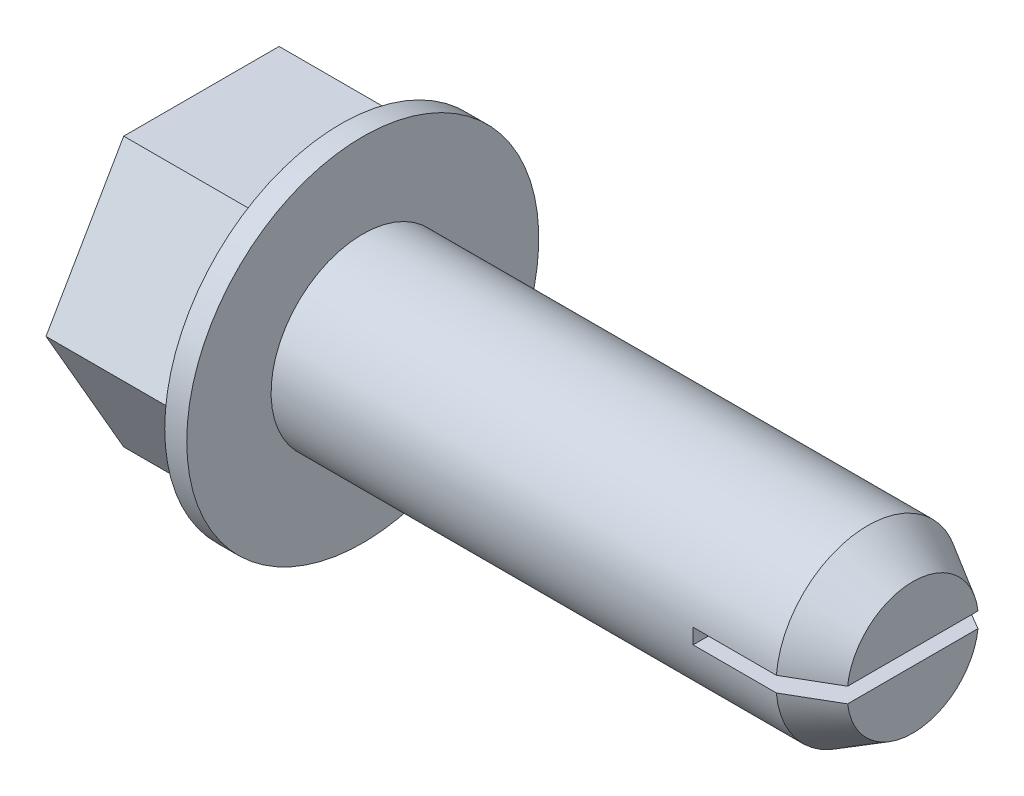
ISO-10303-21;
HEADER;
FILE_DESCRIPTION(('STEP AP214'),'2;1');
FILE_NAME('part.step','',(''),(''),'','','');
FILE_SCHEMA(('AUTOMOTIVE_DESIGN { 1 0 10303 214 1 1 1 1 }'));
ENDSEC;
DATA;
#1=APPLICATION_CONTEXT('core data for automotive mechanical design processes');
#2=APPLICATION_PROTOCOL_DEFINITION('international standard','automotive_design',2000,#1);
#3=PRODUCT_CONTEXT('',#1,'mechanical');
#4=PRODUCT('Part','Part','',(#3));
#5=PRODUCT_RELATED_PRODUCT_CATEGORY('part','',(#4));
#6=PRODUCT_DEFINITION_FORMATION('','',#4);
#7=PRODUCT_DEFINITION_CONTEXT('part definition',#1,'design');
#8=PRODUCT_DEFINITION('design','',#6,#7);
#9=PRODUCT_DEFINITION_SHAPE('','',#8);
#10=(LENGTH_UNIT() NAMED_UNIT(*) SI_UNIT(.MILLI.,.METRE.));
#11=(NAMED_UNIT(*) PLANE_ANGLE_UNIT() SI_UNIT($,.RADIAN.));
#12=(NAMED_UNIT(*) SI_UNIT($,.STERADIAN.) SOLID_ANGLE_UNIT());
#13=UNCERTAINTY_MEASURE_WITH_UNIT(LENGTH_MEASURE(1.E-05),#10,'distance_accuracy_value','');
#14=(GEOMETRIC_REPRESENTATION_CONTEXT(3) GLOBAL_UNCERTAINTY_ASSIGNED_CONTEXT((#13)) GLOBAL_UNIT_ASSIGNED_CONTEXT((#10,
#11,#12)) REPRESENTATION_CONTEXT('',''));
#15=CARTESIAN_POINT('',(0.,0.,0.));
#16=DIRECTION('',(0.,0.,1.));
#17=DIRECTION('',(1.,0.,0.));
#18=AXIS2_PLACEMENT_3D('',#15,#16,#17);
#19=CARTESIAN_POINT('',(14.605,0.,0.));
#20=DIRECTION('',(1.,0.,0.));
#21=DIRECTION('',(0.,0.,-1.));
#22=AXIS2_PLACEMENT_3D('',#19,#20,#21);
#23=PLANE('',#22);
#24=CARTESIAN_POINT('',(14.605,0.,0.));
#25=DIRECTION('',(1.,0.,0.));
#26=DIRECTION('',(0.,0.,-1.));
#27=AXIS2_PLACEMENT_3D('',#24,#25,#26);
#28=CIRCLE('',#27,3.175);
#29=CARTESIAN_POINT('',(14.605,-0.264583333333333,-3.16395648827891));
#30=VERTEX_POINT('',#29);
#31=CARTESIAN_POINT('',(14.605,0.264583333333333,-3.16395648827891));
#32=VERTEX_POINT('',#31);
#33=EDGE_CURVE('E167',#30,#32,#28,.T.);
#34=ORIENTED_EDGE('',*,*,#33,.T.);
#35=DIRECTION('',(0.,0.,-1.));
#36=VECTOR('',#35,1.);
#37=CARTESIAN_POINT('',(14.605,0.264583333333333,-3.16395648827891));
#38=LINE('',#37,#36);
#39=CARTESIAN_POINT('',(14.605,0.264583333333333,3.16395648827891));
#40=VERTEX_POINT('',#39);
#41=EDGE_CURVE('E151',#40,#32,#38,.T.);
#42=ORIENTED_EDGE('',*,*,#41,.F.);
#43=CARTESIAN_POINT('',(14.605,-0.264583333333333,3.16395648827891));
#44=VERTEX_POINT('',#43);
#45=EDGE_CURVE('E171',#40,#44,#28,.T.);
#46=ORIENTED_EDGE('',*,*,#45,.T.);
#47=DIRECTION('',(0.,0.,-1.));
#48=VECTOR('',#47,1.);
#49=CARTESIAN_POINT('',(14.605,-0.264583333333333,3.16395648827891));
#50=LINE('',#49,#48);
#51=EDGE_CURVE('E170',#44,#30,#50,.T.);
#52=ORIENTED_EDGE('',*,*,#51,.T.);
#53=EDGE_LOOP('',(#34,#42,#46,#52));
#54=FACE_BOUND('',#53,.T.);
#55=ADVANCED_FACE('F32',(#54),#23,.T.);
#56=CARTESIAN_POINT('',(0.,0.,0.));
#57=DIRECTION('',(-1.,0.,0.));
#58=DIRECTION('',(0.,0.,1.));
#59=AXIS2_PLACEMENT_3D('',#56,#57,#58);
#60=CYLINDRICAL_SURFACE('',#59,6.096);
#61=CARTESIAN_POINT('',(0.,0.,0.));
#62=DIRECTION('',(-1.,0.,0.));
#63=DIRECTION('',(0.,0.,1.));
#64=AXIS2_PLACEMENT_3D('',#61,#62,#63);
#65=CIRCLE('',#64,6.096);
#66=CARTESIAN_POINT('',(0.,0.,6.096));
#67=VERTEX_POINT('',#66);
#68=EDGE_CURVE('E185',#67,#67,#65,.T.);
#69=ORIENTED_EDGE('',*,*,#68,.T.);
#70=EDGE_LOOP('',(#69));
#71=FACE_BOUND('',#70,.T.);
#72=CARTESIAN_POINT('',(-0.762,0.,0.));
#73=DIRECTION('',(-1.,0.,0.));
#74=DIRECTION('',(0.,0.,1.));
#75=AXIS2_PLACEMENT_3D('',#72,#73,#74);
#76=CIRCLE('',#75,6.096);
#77=CARTESIAN_POINT('',(-0.762,0.,6.096));
#78=VERTEX_POINT('',#77);
#79=EDGE_CURVE('E179',#78,#78,#76,.T.);
#80=ORIENTED_EDGE('',*,*,#79,.F.);
#81=EDGE_LOOP('',(#80));
#82=FACE_BOUND('',#81,.T.);
#83=ADVANCED_FACE('F217',(#71,#82),#60,.T.);
#84=CARTESIAN_POINT('',(0.,6.096,0.));
#85=DIRECTION('',(1.,0.,0.));
#86=DIRECTION('',(0.,0.,-1.));
#87=AXIS2_PLACEMENT_3D('',#84,#85,#86);
#88=PLANE('',#87);
#89=CARTESIAN_POINT('',(0.,0.,0.));
#90=DIRECTION('',(1.,0.,0.));
#91=DIRECTION('',(0.,0.,-1.));
#92=AXIS2_PLACEMENT_3D('',#89,#90,#91);
#93=CIRCLE('',#92,3.175);
#94=CARTESIAN_POINT('',(0.,0.,-3.175));
#95=VERTEX_POINT('',#94);
#96=EDGE_CURVE('E181',#95,#95,#93,.T.);
#97=ORIENTED_EDGE('',*,*,#96,.F.);
#98=EDGE_LOOP('',(#97));
#99=FACE_BOUND('',#98,.T.);
#100=ORIENTED_EDGE('',*,*,#68,.F.);
#101=EDGE_LOOP('',(#100));
#102=FACE_BOUND('',#101,.T.);
#103=ADVANCED_FACE('F332',(#99,#102),#88,.T.);
#104=CARTESIAN_POINT('',(-0.762,0.,0.));
#105=DIRECTION('',(-1.,0.,0.));
#106=DIRECTION('',(0.,0.,1.));
#107=AXIS2_PLACEMENT_3D('',#104,#105,#106);
#108=PLANE('',#107);
#109=DIRECTION('',(0.,0.,1.));
#110=VECTOR('',#109,1.);
#111=CARTESIAN_POINT('',(-0.762,-4.6609,2.69097186966593));
#112=LINE('',#111,#110);
#113=CARTESIAN_POINT('',(-0.762,-4.6609,-2.69097186966593));
#114=VERTEX_POINT('',#113);
#115=CARTESIAN_POINT('',(-0.762,-4.6609,2.69097186966593));
#116=VERTEX_POINT('',#115);
#117=EDGE_CURVE('E150',#114,#116,#112,.T.);
#118=ORIENTED_EDGE('',*,*,#117,.F.);
#119=DIRECTION('',(0.,-0.866025403784439,0.5));
#120=VECTOR('',#119,1.);
#121=CARTESIAN_POINT('',(-0.762,-4.6609,-2.69097186966593));
#122=LINE('',#121,#120);
#123=CARTESIAN_POINT('',(-0.762,0.,-5.38194373933185));
#124=VERTEX_POINT('',#123);
#125=EDGE_CURVE('E147',#124,#114,#122,.T.);
#126=ORIENTED_EDGE('',*,*,#125,.F.);
#127=DIRECTION('',(0.,-0.866025403784439,-0.5));
#128=VECTOR('',#127,1.);
#129=CARTESIAN_POINT('',(-0.762,0.,-5.38194373933185));
#130=LINE('',#129,#128);
#131=CARTESIAN_POINT('',(-0.762,4.6609,-2.69097186966592));
#132=VERTEX_POINT('',#131);
#133=EDGE_CURVE('E311',#132,#124,#130,.T.);
#134=ORIENTED_EDGE('',*,*,#133,.F.);
#135=DIRECTION('',(0.,0.,-1.));
#136=VECTOR('',#135,1.);
#137=CARTESIAN_POINT('',(-0.762,4.6609,-2.69097186966592));
#138=LINE('',#137,#136);
#139=CARTESIAN_POINT('',(-0.762,4.6609,2.69097186966593));
#140=VERTEX_POINT('',#139);
#141=EDGE_CURVE('E308',#140,#132,#138,.T.);
#142=ORIENTED_EDGE('',*,*,#141,.F.);
#143=DIRECTION('',(0.,0.866025403784439,-0.5));
#144=VECTOR('',#143,1.);
#145=CARTESIAN_POINT('',(-0.762,4.6609,2.69097186966593));
#146=LINE('',#145,#144);
#147=CARTESIAN_POINT('',(-0.762,0.,5.38194373933185));
#148=VERTEX_POINT('',#147);
#149=EDGE_CURVE('E305',#148,#140,#146,.T.);
#150=ORIENTED_EDGE('',*,*,#149,.F.);
#151=DIRECTION('',(0.,0.866025403784439,0.5));
#152=VECTOR('',#151,1.);
#153=CARTESIAN_POINT('',(-0.762,0.,5.38194373933185));
#154=LINE('',#153,#152);
#155=EDGE_CURVE('E303',#116,#148,#154,.T.);
#156=ORIENTED_EDGE('',*,*,#155,.F.);
#157=EDGE_LOOP('',(#118,#126,#134,#142,#150,#156));
#158=FACE_BOUND('',#157,.T.);
#159=ORIENTED_EDGE('',*,*,#79,.T.);
#160=EDGE_LOOP('',(#159));
#161=FACE_BOUND('',#160,.T.);
#162=ADVANCED_FACE('F327',(#158,#161),#108,.T.);
#163=CARTESIAN_POINT('',(19.05,0.,0.));
#164=DIRECTION('',(-1.,0.,0.));
#165=DIRECTION('',(0.,0.,1.));
#166=AXIS2_PLACEMENT_3D('',#163,#164,#165);
#167=CYLINDRICAL_SURFACE('',#166,3.175);
#168=DIRECTION('',(-1.,0.,0.));
#169=VECTOR('',#168,1.);
#170=CARTESIAN_POINT('',(19.05,0.264583333333333,3.16395648827891));
#171=LINE('',#170,#169);
#172=CARTESIAN_POINT('',(17.4882097868374,0.264583333333333,3.16395648827891));
#173=VERTEX_POINT('',#172);
#174=EDGE_CURVE('E164',#173,#40,#171,.T.);
#175=ORIENTED_EDGE('',*,*,#174,.F.);
#176=CARTESIAN_POINT('',(17.4882097868374,0.,0.));
#177=DIRECTION('',(-1.,0.,0.));
#178=DIRECTION('',(0.,0.,1.));
#179=AXIS2_PLACEMENT_3D('',#176,#177,#178);
#180=CIRCLE('',#179,3.175);
#181=CARTESIAN_POINT('',(17.4882097868374,0.264583333333333,-3.16395648827891));
#182=VERTEX_POINT('',#181);
#183=EDGE_CURVE('E231',#173,#182,#180,.T.);
#184=ORIENTED_EDGE('',*,*,#183,.T.);
#185=DIRECTION('',(-1.,0.,0.));
#186=VECTOR('',#185,1.);
#187=CARTESIAN_POINT('',(19.05,0.264583333333333,-3.16395648827891));
#188=LINE('',#187,#186);
#189=EDGE_CURVE('E161',#182,#32,#188,.T.);
#190=ORIENTED_EDGE('',*,*,#189,.T.);
#191=ORIENTED_EDGE('',*,*,#33,.F.);
#192=DIRECTION('',(1.,0.,0.));
#193=VECTOR('',#192,1.);
#194=CARTESIAN_POINT('',(14.605,-0.264583333333333,-3.16395648827891));
#195=LINE('',#194,#193);
#196=CARTESIAN_POINT('',(17.4882097868374,-0.264583333333333,-3.16395648827891));
#197=VERTEX_POINT('',#196);
#198=EDGE_CURVE('E176',#30,#197,#195,.T.);
#199=ORIENTED_EDGE('',*,*,#198,.T.);
#200=CARTESIAN_POINT('',(17.4882097868374,0.,0.));
#201=DIRECTION('',(1.,0.,0.));
#202=DIRECTION('',(0.,0.,-1.));
#203=AXIS2_PLACEMENT_3D('',#200,#201,#202);
#204=CIRCLE('',#203,3.175);
#205=CARTESIAN_POINT('',(17.4882097868374,-0.264583333333333,3.16395648827891));
#206=VERTEX_POINT('',#205);
#207=EDGE_CURVE('E232',#197,#206,#204,.F.);
#208=ORIENTED_EDGE('',*,*,#207,.T.);
#209=DIRECTION('',(1.,0.,0.));
#210=VECTOR('',#209,1.);
#211=CARTESIAN_POINT('',(14.605,-0.264583333333333,3.16395648827891));
#212=LINE('',#211,#210);
#213=EDGE_CURVE('E174',#44,#206,#212,.T.);
#214=ORIENTED_EDGE('',*,*,#213,.F.);
#215=ORIENTED_EDGE('',*,*,#45,.F.);
#216=EDGE_LOOP('',(#175,#184,#190,#191,#199,#208,#214,#215));
#217=FACE_BOUND('',#216,.T.);
#218=ORIENTED_EDGE('',*,*,#96,.T.);
#219=EDGE_LOOP('',(#218));
#220=FACE_BOUND('',#219,.T.);
#221=ADVANCED_FACE('F242',(#217,#220),#167,.T.);
#222=CARTESIAN_POINT('',(19.05,0.,0.));
#223=DIRECTION('',(1.,0.,0.));
#224=DIRECTION('',(0.,0.,-1.));
#225=AXIS2_PLACEMENT_3D('',#222,#223,#224);
#226=PLANE('',#225);
#227=DIRECTION('',(0.,0.,-1.));
#228=VECTOR('',#227,1.);
#229=CARTESIAN_POINT('',(19.05,-0.264583333333333,3.16395648827891));
#230=LINE('',#229,#228);
#231=CARTESIAN_POINT('',(19.05,-0.264583333333333,2.25785042678681));
#232=VERTEX_POINT('',#231);
#233=CARTESIAN_POINT('',(19.05,-0.264583333333333,-2.25785042678681));
#234=VERTEX_POINT('',#233);
#235=EDGE_CURVE('E166',#232,#234,#230,.T.);
#236=ORIENTED_EDGE('',*,*,#235,.F.);
#237=CARTESIAN_POINT('',(19.05,0.,0.));
#238=DIRECTION('',(1.,0.,0.));
#239=DIRECTION('',(0.,0.,-1.));
#240=AXIS2_PLACEMENT_3D('',#237,#238,#239);
#241=CIRCLE('',#240,2.27330000000421);
#242=EDGE_CURVE('E229',#232,#234,#241,.T.);
#243=ORIENTED_EDGE('',*,*,#242,.T.);
#244=EDGE_LOOP('',(#236,#243));
#245=FACE_BOUND('',#244,.T.);
#246=ADVANCED_FACE('F222',(#245),#226,.T.);
#247=CARTESIAN_POINT('',(14.605,-0.264583333333333,3.16395648827891));
#248=DIRECTION('',(0.,-1.,0.));
#249=DIRECTION('',(0.,0.,-1.));
#250=AXIS2_PLACEMENT_3D('',#247,#248,#249);
#251=PLANE('',#250);
#252=ORIENTED_EDGE('',*,*,#235,.T.);
#253=CARTESIAN_POINT('',(19.05,-0.264583333333333,-2.25785042678681));
#254=CARTESIAN_POINT('',(18.9199136361942,-0.264583333333333,-2.33346750791042));
#255=CARTESIAN_POINT('',(18.7898067189653,-0.264583333333333,-2.40904920794246));
#256=CARTESIAN_POINT('',(18.5295590617443,-0.264583333333333,-2.56015431967211));
#257=CARTESIAN_POINT('',(18.3994183217566,-0.264583333333333,-2.63567773137704));
#258=CARTESIAN_POINT('',(18.0089562455132,-0.264583333333333,-2.86217927280469));
#259=CARTESIAN_POINT('',(17.7485950521503,-0.264583333333333,-3.01308870932084));
#260=CARTESIAN_POINT('',(17.4882097868374,-0.264583333333333,-3.16395648827891));
#261=B_SPLINE_CURVE_WITH_KNOTS('',3,(#253,#254,#255,#256,#257,#258,#259,#260),.UNSPECIFIED.,.F.,
.F.,(4,2,2,4),(0.,0.451401842557992,0.902803628343581,1.80560719704494),.UNSPECIFIED.);
#262=EDGE_CURVE('E11',#234,#197,#261,.T.);
#263=ORIENTED_EDGE('',*,*,#262,.T.);
#264=ORIENTED_EDGE('',*,*,#198,.F.);
#265=ORIENTED_EDGE('',*,*,#51,.F.);
#266=ORIENTED_EDGE('',*,*,#213,.T.);
#267=CARTESIAN_POINT('',(17.4882097868374,-0.264583333333333,3.16395648827891));
#268=CARTESIAN_POINT('',(17.7485950521503,-0.264583333333333,3.01308870932084));
#269=CARTESIAN_POINT('',(18.0089562455132,-0.264583333333333,2.86217927280469));
#270=CARTESIAN_POINT('',(18.3994183217566,-0.264583333333333,2.63567773137704));
#271=CARTESIAN_POINT('',(18.5295590617443,-0.264583333333333,2.56015431967211));
#272=CARTESIAN_POINT('',(18.7898067189653,-0.264583333333333,2.40904920794246));
#273=CARTESIAN_POINT('',(18.9199136361942,-0.264583333333333,2.33346750791042));
#274=CARTESIAN_POINT('',(19.05,-0.264583333333333,2.25785042678681));
#275=B_SPLINE_CURVE_WITH_KNOTS('',3,(#267,#268,#269,#270,#271,#272,#273,#274),.UNSPECIFIED.,.F.,
.F.,(4,2,2,4),(0.,0.902803568701357,1.35420535448695,1.80560719704494),.UNSPECIFIED.);
#276=EDGE_CURVE('E45',#206,#232,#275,.T.);
#277=ORIENTED_EDGE('',*,*,#276,.T.);
#278=EDGE_LOOP('',(#252,#263,#264,#265,#266,#277));
#279=FACE_BOUND('',#278,.T.);
#280=ADVANCED_FACE('F212',(#279),#251,.F.);
#281=CARTESIAN_POINT('',(19.05,0.264583333333333,-3.16395648827891));
#282=DIRECTION('',(0.,1.,0.));
#283=DIRECTION('',(0.,0.,1.));
#284=AXIS2_PLACEMENT_3D('',#281,#282,#283);
#285=PLANE('',#284);
#286=DIRECTION('',(0.,0.,-1.));
#287=VECTOR('',#286,1.);
#288=CARTESIAN_POINT('',(19.05,0.264583333333333,-3.16395648827891));
#289=LINE('',#288,#287);
#290=CARTESIAN_POINT('',(19.05,0.264583333333333,2.25785042678681));
#291=VERTEX_POINT('',#290);
#292=CARTESIAN_POINT('',(19.05,0.264583333333333,-2.25785042678681));
#293=VERTEX_POINT('',#292);
#294=EDGE_CURVE('E154',#291,#293,#289,.T.);
#295=ORIENTED_EDGE('',*,*,#294,.F.);
#296=CARTESIAN_POINT('',(19.05,0.264583333333333,2.25785042678681));
#297=CARTESIAN_POINT('',(18.9199136361942,0.264583333333333,2.33346750791042));
#298=CARTESIAN_POINT('',(18.7898067189653,0.264583333333333,2.40904920794246));
#299=CARTESIAN_POINT('',(18.5295590617443,0.264583333333333,2.56015431967211));
#300=CARTESIAN_POINT('',(18.3994183217566,0.264583333333333,2.63567773137704));
#301=CARTESIAN_POINT('',(18.0089562455132,0.264583333333333,2.86217927280469));
#302=CARTESIAN_POINT('',(17.7485950521503,0.264583333333333,3.01308870932084));
#303=CARTESIAN_POINT('',(17.4882097868374,0.264583333333333,3.16395648827891));
#304=B_SPLINE_CURVE_WITH_KNOTS('',3,(#296,#297,#298,#299,#300,#301,#302,#303),.UNSPECIFIED.,.F.,
.F.,(4,2,2,4),(0.,0.451401842557992,0.902803628343581,1.80560719704494),.UNSPECIFIED.);
#305=EDGE_CURVE('E198',#291,#173,#304,.T.);
#306=ORIENTED_EDGE('',*,*,#305,.T.);
#307=ORIENTED_EDGE('',*,*,#174,.T.);
#308=ORIENTED_EDGE('',*,*,#41,.T.);
#309=ORIENTED_EDGE('',*,*,#189,.F.);
#310=CARTESIAN_POINT('',(17.4882097868374,0.264583333333333,-3.16395648827891));
#311=CARTESIAN_POINT('',(17.7485950521503,0.264583333333333,-3.01308870932084));
#312=CARTESIAN_POINT('',(18.0089562455132,0.264583333333333,-2.86217927280469));
#313=CARTESIAN_POINT('',(18.3994183217566,0.264583333333333,-2.63567773137704));
#314=CARTESIAN_POINT('',(18.5295590617443,0.264583333333333,-2.56015431967211));
#315=CARTESIAN_POINT('',(18.7898067189653,0.264583333333333,-2.40904920794246));
#316=CARTESIAN_POINT('',(18.9199136361942,0.264583333333333,-2.33346750791042));
#317=CARTESIAN_POINT('',(19.05,0.264583333333333,-2.25785042678681));
#318=B_SPLINE_CURVE_WITH_KNOTS('',3,(#310,#311,#312,#313,#314,#315,#316,#317),.UNSPECIFIED.,.F.,
.F.,(4,2,2,4),(0.,0.902803568701357,1.35420535448695,1.80560719704494),.UNSPECIFIED.);
#319=EDGE_CURVE('E192',#182,#293,#318,.T.);
#320=ORIENTED_EDGE('',*,*,#319,.T.);
#321=EDGE_LOOP('',(#295,#306,#307,#308,#309,#320));
#322=FACE_BOUND('',#321,.T.);
#323=ADVANCED_FACE('F206',(#322),#285,.F.);
#324=CARTESIAN_POINT('',(19.05,0.,0.));
#325=DIRECTION('',(-1.,0.,0.));
#326=DIRECTION('',(0.,0.,1.));
#327=AXIS2_PLACEMENT_3D('',#324,#325,#326);
#328=PLANE('',#327);
#329=ORIENTED_EDGE('',*,*,#294,.T.);
#330=CARTESIAN_POINT('',(19.05,0.,0.));
#331=DIRECTION('',(-1.,0.,0.));
#332=DIRECTION('',(0.,0.,1.));
#333=AXIS2_PLACEMENT_3D('',#330,#331,#332);
#334=CIRCLE('',#333,2.27330000000421);
#335=EDGE_CURVE('E184',#293,#291,#334,.F.);
#336=ORIENTED_EDGE('',*,*,#335,.T.);
#337=EDGE_LOOP('',(#329,#336));
#338=FACE_BOUND('',#337,.T.);
#339=ADVANCED_FACE('F211',(#338),#328,.F.);
#340=CARTESIAN_POINT('',(-5.588,-4.6609,2.69097186966593));
#341=DIRECTION('',(0.,1.,0.));
#342=DIRECTION('',(0.,0.,1.));
#343=AXIS2_PLACEMENT_3D('',#340,#341,#342);
#344=PLANE('',#343);
#345=ORIENTED_EDGE('',*,*,#117,.T.);
#346=DIRECTION('',(1.,0.,0.));
#347=VECTOR('',#346,1.);
#348=CARTESIAN_POINT('',(-5.588,-4.6609,2.69097186966593));
#349=LINE('',#348,#347);
#350=CARTESIAN_POINT('',(-5.588,-4.6609,2.69097186966593));
#351=VERTEX_POINT('',#350);
#352=EDGE_CURVE('E131',#351,#116,#349,.T.);
#353=ORIENTED_EDGE('',*,*,#352,.F.);
#354=DIRECTION('',(0.,0.,1.));
#355=VECTOR('',#354,1.);
#356=CARTESIAN_POINT('',(-5.588,-4.6609,2.69097186966593));
#357=LINE('',#356,#355);
#358=CARTESIAN_POINT('',(-5.588,-4.6609,-2.69097186966593));
#359=VERTEX_POINT('',#358);
#360=EDGE_CURVE('E138',#359,#351,#357,.T.);
#361=ORIENTED_EDGE('',*,*,#360,.F.);
#362=DIRECTION('',(1.,0.,0.));
#363=VECTOR('',#362,1.);
#364=CARTESIAN_POINT('',(-5.588,-4.6609,-2.69097186966593));
#365=LINE('',#364,#363);
#366=EDGE_CURVE('E301',#359,#114,#365,.T.);
#367=ORIENTED_EDGE('',*,*,#366,.T.);
#368=EDGE_LOOP('',(#345,#353,#361,#367));
#369=FACE_BOUND('',#368,.T.);
#370=ADVANCED_FACE('F149',(#369),#344,.F.);
#371=CARTESIAN_POINT('',(-5.588,0.,5.38194373933185));
#372=DIRECTION('',(0.,0.5,-0.866025403784439));
#373=DIRECTION('',(0.,0.866025403784439,0.5));
#374=AXIS2_PLACEMENT_3D('',#371,#372,#373);
#375=PLANE('',#374);
#376=ORIENTED_EDGE('',*,*,#155,.T.);
#377=DIRECTION('',(1.,0.,0.));
#378=VECTOR('',#377,1.);
#379=CARTESIAN_POINT('',(-5.588,0.,5.38194373933185));
#380=LINE('',#379,#378);
#381=CARTESIAN_POINT('',(-5.588,0.,5.38194373933185));
#382=VERTEX_POINT('',#381);
#383=EDGE_CURVE('E134',#382,#148,#380,.T.);
#384=ORIENTED_EDGE('',*,*,#383,.F.);
#385=DIRECTION('',(0.,0.866025403784439,0.5));
#386=VECTOR('',#385,1.);
#387=CARTESIAN_POINT('',(-5.588,0.,5.38194373933185));
#388=LINE('',#387,#386);
#389=EDGE_CURVE('E126',#351,#382,#388,.T.);
#390=ORIENTED_EDGE('',*,*,#389,.F.);
#391=ORIENTED_EDGE('',*,*,#352,.T.);
#392=EDGE_LOOP('',(#376,#384,#390,#391));
#393=FACE_BOUND('',#392,.T.);
#394=ADVANCED_FACE('F129',(#393),#375,.F.);
#395=CARTESIAN_POINT('',(-5.588,4.6609,2.69097186966593));
#396=DIRECTION('',(0.,-0.5,-0.866025403784439));
#397=DIRECTION('',(0.,0.866025403784439,-0.5));
#398=AXIS2_PLACEMENT_3D('',#395,#396,#397);
#399=PLANE('',#398);
#400=ORIENTED_EDGE('',*,*,#149,.T.);
#401=DIRECTION('',(1.,0.,0.));
#402=VECTOR('',#401,1.);
#403=CARTESIAN_POINT('',(-5.588,4.6609,2.69097186966593));
#404=LINE('',#403,#402);
#405=CARTESIAN_POINT('',(-5.588,4.6609,2.69097186966593));
#406=VERTEX_POINT('',#405);
#407=EDGE_CURVE('E156',#406,#140,#404,.T.);
#408=ORIENTED_EDGE('',*,*,#407,.F.);
#409=DIRECTION('',(0.,0.866025403784439,-0.5));
#410=VECTOR('',#409,1.);
#411=CARTESIAN_POINT('',(-5.588,4.6609,2.69097186966593));
#412=LINE('',#411,#410);
#413=EDGE_CURVE('E137',#382,#406,#412,.T.);
#414=ORIENTED_EDGE('',*,*,#413,.F.);
#415=ORIENTED_EDGE('',*,*,#383,.T.);
#416=EDGE_LOOP('',(#400,#408,#414,#415));
#417=FACE_BOUND('',#416,.T.);
#418=ADVANCED_FACE('F254',(#417),#399,.F.);
#419=CARTESIAN_POINT('',(-5.588,4.6609,-2.69097186966592));
#420=DIRECTION('',(0.,-1.,0.));
#421=DIRECTION('',(0.,0.,-1.));
#422=AXIS2_PLACEMENT_3D('',#419,#420,#421);
#423=PLANE('',#422);
#424=ORIENTED_EDGE('',*,*,#141,.T.);
#425=DIRECTION('',(1.,0.,0.));
#426=VECTOR('',#425,1.);
#427=CARTESIAN_POINT('',(-5.588,4.6609,-2.69097186966592));
#428=LINE('',#427,#426);
#429=CARTESIAN_POINT('',(-5.588,4.6609,-2.69097186966592));
#430=VERTEX_POINT('',#429);
#431=EDGE_CURVE('E320',#430,#132,#428,.T.);
#432=ORIENTED_EDGE('',*,*,#431,.F.);
#433=DIRECTION('',(0.,0.,-1.));
#434=VECTOR('',#433,1.);
#435=CARTESIAN_POINT('',(-5.588,4.6609,-2.69097186966592));
#436=LINE('',#435,#434);
#437=EDGE_CURVE('E296',#406,#430,#436,.T.);
#438=ORIENTED_EDGE('',*,*,#437,.F.);
#439=ORIENTED_EDGE('',*,*,#407,.T.);
#440=EDGE_LOOP('',(#424,#432,#438,#439));
#441=FACE_BOUND('',#440,.T.);
#442=ADVANCED_FACE('F259',(#441),#423,.F.);
#443=CARTESIAN_POINT('',(-5.588,0.,-5.38194373933185));
#444=DIRECTION('',(0.,-0.5,0.866025403784439));
#445=DIRECTION('',(0.,-0.866025403784439,-0.5));
#446=AXIS2_PLACEMENT_3D('',#443,#444,#445);
#447=PLANE('',#446);
#448=ORIENTED_EDGE('',*,*,#133,.T.);
#449=DIRECTION('',(1.,0.,0.));
#450=VECTOR('',#449,1.);
#451=CARTESIAN_POINT('',(-5.588,0.,-5.38194373933185));
#452=LINE('',#451,#450);
#453=CARTESIAN_POINT('',(-5.588,0.,-5.38194373933185));
#454=VERTEX_POINT('',#453);
#455=EDGE_CURVE('E317',#454,#124,#452,.T.);
#456=ORIENTED_EDGE('',*,*,#455,.F.);
#457=DIRECTION('',(0.,-0.866025403784439,-0.5));
#458=VECTOR('',#457,1.);
#459=CARTESIAN_POINT('',(-5.588,0.,-5.38194373933185));
#460=LINE('',#459,#458);
#461=EDGE_CURVE('E298',#430,#454,#460,.T.);
#462=ORIENTED_EDGE('',*,*,#461,.F.);
#463=ORIENTED_EDGE('',*,*,#431,.T.);
#464=EDGE_LOOP('',(#448,#456,#462,#463));
#465=FACE_BOUND('',#464,.T.);
#466=ADVANCED_FACE('F263',(#465),#447,.F.);
#467=CARTESIAN_POINT('',(-5.588,-4.6609,-2.69097186966593));
#468=DIRECTION('',(0.,0.5,0.866025403784439));
#469=DIRECTION('',(0.,-0.866025403784439,0.5));
#470=AXIS2_PLACEMENT_3D('',#467,#468,#469);
#471=PLANE('',#470);
#472=ORIENTED_EDGE('',*,*,#125,.T.);
#473=ORIENTED_EDGE('',*,*,#366,.F.);
#474=DIRECTION('',(0.,-0.866025403784439,0.5));
#475=VECTOR('',#474,1.);
#476=CARTESIAN_POINT('',(-5.588,-4.6609,-2.69097186966593));
#477=LINE('',#476,#475);
#478=EDGE_CURVE('E143',#454,#359,#477,.T.);
#479=ORIENTED_EDGE('',*,*,#478,.F.);
#480=ORIENTED_EDGE('',*,*,#455,.T.);
#481=EDGE_LOOP('',(#472,#473,#479,#480));
#482=FACE_BOUND('',#481,.T.);
#483=ADVANCED_FACE('F267',(#482),#471,.F.);
#484=CARTESIAN_POINT('',(-5.588,0.,0.));
#485=DIRECTION('',(1.,0.,0.));
#486=DIRECTION('',(0.,0.,-1.));
#487=AXIS2_PLACEMENT_3D('',#484,#485,#486);
#488=PLANE('',#487);
#489=CARTESIAN_POINT('',(-5.588,4.25938424711709E-12,2.70507230582059E-11));
#490=DIRECTION('',(-1.,0.,-4.84085953075596E-12));
#491=DIRECTION('',(-4.84085953075596E-12,0.,1.));
#492=AXIS2_PLACEMENT_3D('',#489,#490,#491);
#493=CIRCLE('',#492,3.72871999999999);
#494=CARTESIAN_POINT('',(-5.58800000001805,4.25938424711709E-12,3.72872000002704));
#495=VERTEX_POINT('',#494);
#496=EDGE_CURVE('E291',#495,#495,#493,.T.);
#497=ORIENTED_EDGE('',*,*,#496,.F.);
#498=EDGE_LOOP('',(#497));
#499=FACE_BOUND('',#498,.T.);
#500=ORIENTED_EDGE('',*,*,#360,.T.);
#501=ORIENTED_EDGE('',*,*,#389,.T.);
#502=ORIENTED_EDGE('',*,*,#413,.T.);
#503=ORIENTED_EDGE('',*,*,#437,.T.);
#504=ORIENTED_EDGE('',*,*,#461,.T.);
#505=ORIENTED_EDGE('',*,*,#478,.T.);
#506=EDGE_LOOP('',(#500,#501,#502,#503,#504,#505));
#507=FACE_BOUND('',#506,.T.);
#508=ADVANCED_FACE('F141',(#499,#507),#488,.F.);
#509=CARTESIAN_POINT('',(-4.62280000000001,4.25914784129898E-12,3.17231206772915E-11));
#510=DIRECTION('',(1.,0.,4.84085953075596E-12));
#511=DIRECTION('',(4.84085953075596E-12,0.,-1.));
#512=AXIS2_PLACEMENT_3D('',#509,#510,#511);
#513=PLANE('',#512);
#514=CARTESIAN_POINT('',(-4.6228,4.25938424711709E-12,3.17231206772915E-11));
#515=DIRECTION('',(-1.,0.,-4.84085953075596E-12));
#516=DIRECTION('',(-4.84085953075596E-12,0.,1.));
#517=AXIS2_PLACEMENT_3D('',#514,#515,#516);
#518=CIRCLE('',#517,3.72871999999999);
#519=CARTESIAN_POINT('',(-4.62280000001805,4.25938424711709E-12,3.72872000003171));
#520=VERTEX_POINT('',#519);
#521=EDGE_CURVE('E288',#520,#520,#518,.T.);
#522=ORIENTED_EDGE('',*,*,#521,.T.);
#523=EDGE_LOOP('',(#522));
#524=FACE_BOUND('',#523,.T.);
#525=ADVANCED_FACE('F274',(#524),#513,.F.);
#526=CARTESIAN_POINT('',(-5.588,4.25938424711709E-12,2.70507230582059E-11));
#527=DIRECTION('',(-1.,0.,-4.84085953075596E-12));
#528=DIRECTION('',(-4.84085953075596E-12,0.,1.));
#529=AXIS2_PLACEMENT_3D('',#526,#527,#528);
#530=CYLINDRICAL_SURFACE('',#529,3.72871999999999);
#531=ORIENTED_EDGE('',*,*,#521,.F.);
#532=EDGE_LOOP('',(#531));
#533=FACE_BOUND('',#532,.T.);
#534=ORIENTED_EDGE('',*,*,#496,.T.);
#535=EDGE_LOOP('',(#534));
#536=FACE_BOUND('',#535,.T.);
#537=ADVANCED_FACE('F278',(#533,#536),#530,.F.);
#538=CARTESIAN_POINT('',(19.05,0.,0.));
#539=DIRECTION('',(-1.,0.,0.));
#540=DIRECTION('',(0.,0.,1.));
#541=AXIS2_PLACEMENT_3D('',#538,#539,#540);
#542=CONICAL_SURFACE('',#541,2.27330000000421,0.523598775602452);
#543=ORIENTED_EDGE('',*,*,#319,.F.);
#544=ORIENTED_EDGE('',*,*,#183,.F.);
#545=ORIENTED_EDGE('',*,*,#305,.F.);
#546=ORIENTED_EDGE('',*,*,#335,.F.);
#547=EDGE_LOOP('',(#543,#544,#545,#546));
#548=FACE_BOUND('',#547,.T.);
#549=ADVANCED_FACE('F203',(#548),#542,.T.);
#550=CARTESIAN_POINT('',(19.05,0.,0.));
#551=DIRECTION('',(-1.,0.,0.));
#552=DIRECTION('',(0.,0.,1.));
#553=AXIS2_PLACEMENT_3D('',#550,#551,#552);
#554=CONICAL_SURFACE('',#553,2.27330000000421,0.523598775602452);
#555=ORIENTED_EDGE('',*,*,#276,.F.);
#556=ORIENTED_EDGE('',*,*,#207,.F.);
#557=ORIENTED_EDGE('',*,*,#262,.F.);
#558=ORIENTED_EDGE('',*,*,#242,.F.);
#559=EDGE_LOOP('',(#555,#556,#557,#558));
#560=FACE_BOUND('',#559,.T.);
#561=ADVANCED_FACE('F34',(#560),#554,.T.);
#562=CLOSED_SHELL('',(#55,#83,#103,#162,#221,#246,#280,#323,#339,#370,#394,#418,#442,#466,#483,
#508,#525,#537,#549,#561));
#563=MANIFOLD_SOLID_BREP('B2',#562);
#564=ADVANCED_BREP_SHAPE_REPRESENTATION('',(#18,#563),#14);
#565=SHAPE_DEFINITION_REPRESENTATION(#9,#564);
ENDSEC;
END-ISO-10303-21;
